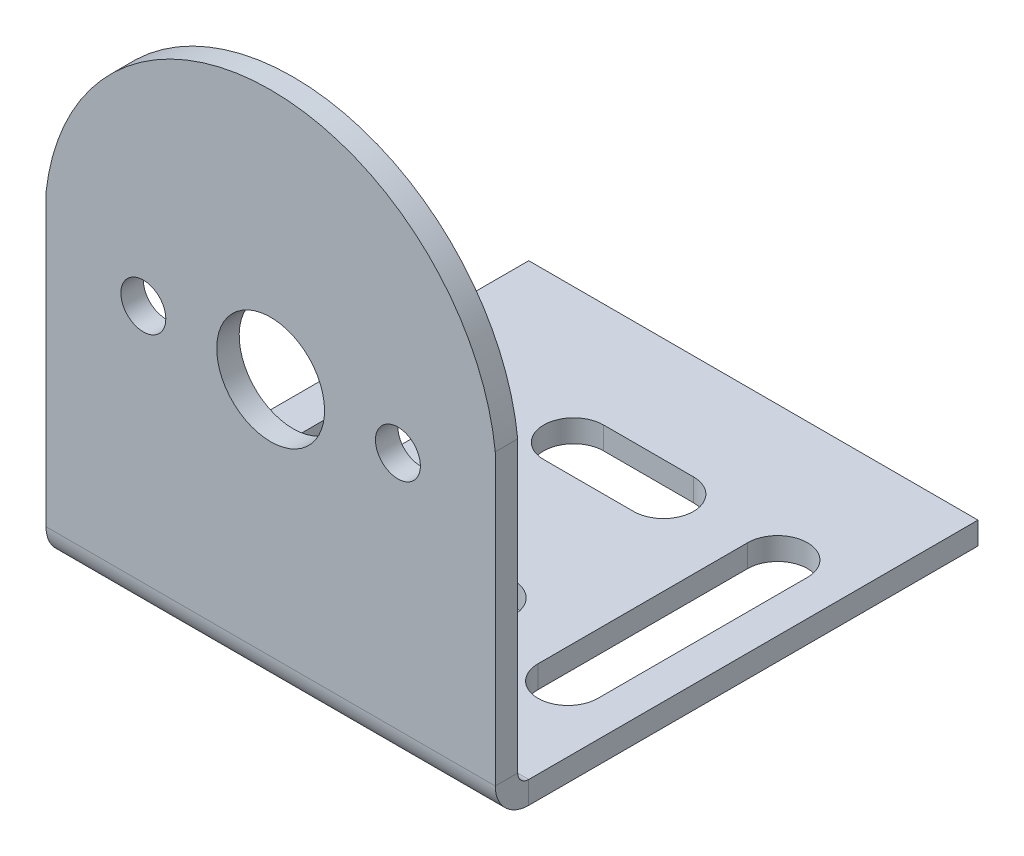
ISO-10303-21;
HEADER;
FILE_DESCRIPTION(('STEP AP214'),'2;1');
FILE_NAME('part.step','',(''),(''),'','','');
FILE_SCHEMA(('AUTOMOTIVE_DESIGN { 1 0 10303 214 1 1 1 1 }'));
ENDSEC;
DATA;
#1=APPLICATION_CONTEXT('core data for automotive mechanical design processes');
#2=APPLICATION_PROTOCOL_DEFINITION('international standard','automotive_design',2000,#1);
#3=PRODUCT_CONTEXT('',#1,'mechanical');
#4=PRODUCT('Part','Part','',(#3));
#5=PRODUCT_RELATED_PRODUCT_CATEGORY('part','',(#4));
#6=PRODUCT_DEFINITION_FORMATION('','',#4);
#7=PRODUCT_DEFINITION_CONTEXT('part definition',#1,'design');
#8=PRODUCT_DEFINITION('design','',#6,#7);
#9=PRODUCT_DEFINITION_SHAPE('','',#8);
#10=(LENGTH_UNIT() NAMED_UNIT(*) SI_UNIT(.MILLI.,.METRE.));
#11=(NAMED_UNIT(*) PLANE_ANGLE_UNIT() SI_UNIT($,.RADIAN.));
#12=(NAMED_UNIT(*) SI_UNIT($,.STERADIAN.) SOLID_ANGLE_UNIT());
#13=UNCERTAINTY_MEASURE_WITH_UNIT(LENGTH_MEASURE(1.E-05),#10,'distance_accuracy_value','');
#14=(GEOMETRIC_REPRESENTATION_CONTEXT(3) GLOBAL_UNCERTAINTY_ASSIGNED_CONTEXT((#13)) GLOBAL_UNIT_ASSIGNED_CONTEXT((#10,
#11,#12)) REPRESENTATION_CONTEXT('',''));
#15=CARTESIAN_POINT('',(0.,0.,0.));
#16=DIRECTION('',(0.,0.,1.));
#17=DIRECTION('',(1.,0.,0.));
#18=AXIS2_PLACEMENT_3D('',#15,#16,#17);
#19=CARTESIAN_POINT('',(-15.,-1.5,15.));
#20=DIRECTION('',(-1.,0.,0.));
#21=DIRECTION('',(0.,0.,1.));
#22=AXIS2_PLACEMENT_3D('',#19,#20,#21);
#23=PLANE('',#22);
#24=DIRECTION('',(0.,0.,1.));
#25=VECTOR('',#24,1.);
#26=CARTESIAN_POINT('',(-15.,0.,15.));
#27=LINE('',#26,#25);
#28=CARTESIAN_POINT('',(-15.,0.,-15.));
#29=VERTEX_POINT('',#28);
#30=CARTESIAN_POINT('',(-15.,0.,15.));
#31=VERTEX_POINT('',#30);
#32=EDGE_CURVE('E421',#29,#31,#27,.T.);
#33=ORIENTED_EDGE('',*,*,#32,.F.);
#34=DIRECTION('',(0.,1.,0.));
#35=VECTOR('',#34,1.);
#36=CARTESIAN_POINT('',(-15.,-1.5,-15.));
#37=LINE('',#36,#35);
#38=CARTESIAN_POINT('',(-15.,-1.5,-15.));
#39=VERTEX_POINT('',#38);
#40=EDGE_CURVE('E13',#39,#29,#37,.T.);
#41=ORIENTED_EDGE('',*,*,#40,.F.);
#42=DIRECTION('',(0.,0.,1.));
#43=VECTOR('',#42,1.);
#44=CARTESIAN_POINT('',(-15.,-1.5,15.));
#45=LINE('',#44,#43);
#46=CARTESIAN_POINT('',(-15.,-1.5,15.));
#47=VERTEX_POINT('',#46);
#48=EDGE_CURVE('E428',#39,#47,#45,.T.);
#49=ORIENTED_EDGE('',*,*,#48,.T.);
#50=DIRECTION('',(0.,1.,0.));
#51=VECTOR('',#50,1.);
#52=CARTESIAN_POINT('',(-15.,-1.5,15.));
#53=LINE('',#52,#51);
#54=EDGE_CURVE('E67',#47,#31,#53,.T.);
#55=ORIENTED_EDGE('',*,*,#54,.T.);
#56=EDGE_LOOP('',(#33,#41,#49,#55));
#57=FACE_BOUND('',#56,.T.);
#58=ADVANCED_FACE('F64',(#57),#23,.T.);
#59=CARTESIAN_POINT('',(15.,-1.5,-15.));
#60=DIRECTION('',(0.,0.,-1.));
#61=DIRECTION('',(-1.,0.,0.));
#62=AXIS2_PLACEMENT_3D('',#59,#60,#61);
#63=PLANE('',#62);
#64=DIRECTION('',(-1.,0.,0.));
#65=VECTOR('',#64,1.);
#66=CARTESIAN_POINT('',(15.,0.,-15.));
#67=LINE('',#66,#65);
#68=CARTESIAN_POINT('',(15.,0.,-15.));
#69=VERTEX_POINT('',#68);
#70=EDGE_CURVE('E431',#69,#29,#67,.T.);
#71=ORIENTED_EDGE('',*,*,#70,.F.);
#72=DIRECTION('',(0.,1.,0.));
#73=VECTOR('',#72,1.);
#74=CARTESIAN_POINT('',(15.,-1.5,-15.));
#75=LINE('',#74,#73);
#76=CARTESIAN_POINT('',(15.,-1.5,-15.));
#77=VERTEX_POINT('',#76);
#78=EDGE_CURVE('E72',#77,#69,#75,.T.);
#79=ORIENTED_EDGE('',*,*,#78,.F.);
#80=DIRECTION('',(-1.,0.,0.));
#81=VECTOR('',#80,1.);
#82=CARTESIAN_POINT('',(15.,-1.5,-15.));
#83=LINE('',#82,#81);
#84=EDGE_CURVE('E436',#77,#39,#83,.T.);
#85=ORIENTED_EDGE('',*,*,#84,.T.);
#86=ORIENTED_EDGE('',*,*,#40,.T.);
#87=EDGE_LOOP('',(#71,#79,#85,#86));
#88=FACE_BOUND('',#87,.T.);
#89=ADVANCED_FACE('F489',(#88),#63,.T.);
#90=CARTESIAN_POINT('',(15.,-1.5,15.));
#91=DIRECTION('',(1.,0.,0.));
#92=DIRECTION('',(0.,0.,-1.));
#93=AXIS2_PLACEMENT_3D('',#90,#91,#92);
#94=PLANE('',#93);
#95=DIRECTION('',(0.,0.,-1.));
#96=VECTOR('',#95,1.);
#97=CARTESIAN_POINT('',(15.,0.,15.));
#98=LINE('',#97,#96);
#99=CARTESIAN_POINT('',(15.,0.,15.));
#100=VERTEX_POINT('',#99);
#101=EDGE_CURVE('E444',#100,#69,#98,.T.);
#102=ORIENTED_EDGE('',*,*,#101,.F.);
#103=DIRECTION('',(0.,1.,0.));
#104=VECTOR('',#103,1.);
#105=CARTESIAN_POINT('',(15.,-1.5,15.));
#106=LINE('',#105,#104);
#107=CARTESIAN_POINT('',(15.,-1.50000000000001,15.));
#108=VERTEX_POINT('',#107);
#109=EDGE_CURVE('E449',#108,#100,#106,.T.);
#110=ORIENTED_EDGE('',*,*,#109,.F.);
#111=DIRECTION('',(0.,0.,-1.));
#112=VECTOR('',#111,1.);
#113=CARTESIAN_POINT('',(15.,-1.5,15.));
#114=LINE('',#113,#112);
#115=EDGE_CURVE('E433',#108,#77,#114,.T.);
#116=ORIENTED_EDGE('',*,*,#115,.T.);
#117=ORIENTED_EDGE('',*,*,#78,.T.);
#118=EDGE_LOOP('',(#102,#110,#116,#117));
#119=FACE_BOUND('',#118,.T.);
#120=ADVANCED_FACE('F493',(#119),#94,.T.);
#121=CARTESIAN_POINT('',(0.,-1.5,0.));
#122=DIRECTION('',(0.,1.,0.));
#123=DIRECTION('',(0.,0.,1.));
#124=AXIS2_PLACEMENT_3D('',#121,#122,#123);
#125=PLANE('',#124);
#126=DIRECTION('',(-1.,0.,0.));
#127=VECTOR('',#126,1.);
#128=CARTESIAN_POINT('',(-3.,-1.5,4.));
#129=LINE('',#128,#127);
#130=CARTESIAN_POINT('',(3.,-1.5,4.00000000000001));
#131=VERTEX_POINT('',#130);
#132=CARTESIAN_POINT('',(-3.,-1.5,4.));
#133=VERTEX_POINT('',#132);
#134=EDGE_CURVE('E311',#131,#133,#129,.T.);
#135=ORIENTED_EDGE('',*,*,#134,.T.);
#136=CARTESIAN_POINT('',(-3.,-1.5,6.));
#137=DIRECTION('',(0.,1.,0.));
#138=DIRECTION('',(0.,0.,-1.));
#139=AXIS2_PLACEMENT_3D('',#136,#137,#138);
#140=CIRCLE('',#139,2.);
#141=CARTESIAN_POINT('',(-3.,-1.5,8.));
#142=VERTEX_POINT('',#141);
#143=EDGE_CURVE('E303',#133,#142,#140,.T.);
#144=ORIENTED_EDGE('',*,*,#143,.T.);
#145=DIRECTION('',(1.,0.,0.));
#146=VECTOR('',#145,1.);
#147=CARTESIAN_POINT('',(-3.,-1.5,8.));
#148=LINE('',#147,#146);
#149=CARTESIAN_POINT('',(3.,-1.5,8.));
#150=VERTEX_POINT('',#149);
#151=EDGE_CURVE('E306',#142,#150,#148,.T.);
#152=ORIENTED_EDGE('',*,*,#151,.T.);
#153=CARTESIAN_POINT('',(3.,-1.5,6.));
#154=DIRECTION('',(0.,1.,0.));
#155=DIRECTION('',(0.,0.,-1.));
#156=AXIS2_PLACEMENT_3D('',#153,#154,#155);
#157=CIRCLE('',#156,2.);
#158=EDGE_CURVE('E80',#150,#131,#157,.T.);
#159=ORIENTED_EDGE('',*,*,#158,.T.);
#160=EDGE_LOOP('',(#135,#144,#152,#159));
#161=FACE_BOUND('',#160,.T.);
#162=DIRECTION('',(-1.,0.,0.));
#163=VECTOR('',#162,1.);
#164=CARTESIAN_POINT('',(-3.,-1.5,-8.));
#165=LINE('',#164,#163);
#166=CARTESIAN_POINT('',(3.,-1.5,-8.));
#167=VERTEX_POINT('',#166);
#168=CARTESIAN_POINT('',(-3.,-1.5,-8.));
#169=VERTEX_POINT('',#168);
#170=EDGE_CURVE('E342',#167,#169,#165,.T.);
#171=ORIENTED_EDGE('',*,*,#170,.T.);
#172=CARTESIAN_POINT('',(-3.,-1.5,-6.));
#173=DIRECTION('',(0.,1.,0.));
#174=DIRECTION('',(0.,0.,1.));
#175=AXIS2_PLACEMENT_3D('',#172,#173,#174);
#176=CIRCLE('',#175,2.);
#177=CARTESIAN_POINT('',(-3.,-1.5,-4.));
#178=VERTEX_POINT('',#177);
#179=EDGE_CURVE('E332',#169,#178,#176,.T.);
#180=ORIENTED_EDGE('',*,*,#179,.T.);
#181=DIRECTION('',(1.,0.,0.));
#182=VECTOR('',#181,1.);
#183=CARTESIAN_POINT('',(-3.,-1.5,-4.));
#184=LINE('',#183,#182);
#185=CARTESIAN_POINT('',(3.,-1.5,-4.));
#186=VERTEX_POINT('',#185);
#187=EDGE_CURVE('E335',#178,#186,#184,.T.);
#188=ORIENTED_EDGE('',*,*,#187,.T.);
#189=CARTESIAN_POINT('',(3.,-1.5,-6.));
#190=DIRECTION('',(0.,1.,0.));
#191=DIRECTION('',(0.,0.,1.));
#192=AXIS2_PLACEMENT_3D('',#189,#190,#191);
#193=CIRCLE('',#192,2.);
#194=EDGE_CURVE('E339',#186,#167,#193,.T.);
#195=ORIENTED_EDGE('',*,*,#194,.T.);
#196=EDGE_LOOP('',(#171,#180,#188,#195));
#197=FACE_BOUND('',#196,.T.);
#198=DIRECTION('',(0.,0.,-1.));
#199=VECTOR('',#198,1.);
#200=CARTESIAN_POINT('',(12.6177163636364,-1.5,-6.));
#201=LINE('',#200,#199);
#202=CARTESIAN_POINT('',(12.6177163636364,-1.5,8.));
#203=VERTEX_POINT('',#202);
#204=CARTESIAN_POINT('',(12.6177163636364,-1.5,-6.));
#205=VERTEX_POINT('',#204);
#206=EDGE_CURVE('E374',#203,#205,#201,.T.);
#207=ORIENTED_EDGE('',*,*,#206,.T.);
#208=CARTESIAN_POINT('',(10.6177163636364,-1.5,-6.));
#209=DIRECTION('',(0.,1.,0.));
#210=DIRECTION('',(0.,0.,-1.));
#211=AXIS2_PLACEMENT_3D('',#208,#209,#210);
#212=CIRCLE('',#211,2.);
#213=CARTESIAN_POINT('',(8.61771636363635,-1.5,-6.));
#214=VERTEX_POINT('',#213);
#215=EDGE_CURVE('E364',#205,#214,#212,.T.);
#216=ORIENTED_EDGE('',*,*,#215,.T.);
#217=DIRECTION('',(0.,0.,1.));
#218=VECTOR('',#217,1.);
#219=CARTESIAN_POINT('',(8.61771636363635,-1.5,-6.));
#220=LINE('',#219,#218);
#221=CARTESIAN_POINT('',(8.61771636363635,-1.5,8.));
#222=VERTEX_POINT('',#221);
#223=EDGE_CURVE('E367',#214,#222,#220,.T.);
#224=ORIENTED_EDGE('',*,*,#223,.T.);
#225=CARTESIAN_POINT('',(10.6177163636364,-1.5,8.));
#226=DIRECTION('',(0.,1.,0.));
#227=DIRECTION('',(0.,0.,-1.));
#228=AXIS2_PLACEMENT_3D('',#225,#226,#227);
#229=CIRCLE('',#228,2.);
#230=EDGE_CURVE('E371',#222,#203,#229,.T.);
#231=ORIENTED_EDGE('',*,*,#230,.T.);
#232=EDGE_LOOP('',(#207,#216,#224,#231));
#233=FACE_BOUND('',#232,.T.);
#234=DIRECTION('',(0.,0.,-1.));
#235=VECTOR('',#234,1.);
#236=CARTESIAN_POINT('',(-8.61771636363636,-1.5,-6.));
#237=LINE('',#236,#235);
#238=CARTESIAN_POINT('',(-8.61771636363635,-1.5,8.));
#239=VERTEX_POINT('',#238);
#240=CARTESIAN_POINT('',(-8.61771636363636,-1.5,-6.));
#241=VERTEX_POINT('',#240);
#242=EDGE_CURVE('E406',#239,#241,#237,.T.);
#243=ORIENTED_EDGE('',*,*,#242,.T.);
#244=CARTESIAN_POINT('',(-10.6177163636364,-1.5,-6.));
#245=DIRECTION('',(0.,1.,0.));
#246=DIRECTION('',(0.,0.,1.));
#247=AXIS2_PLACEMENT_3D('',#244,#245,#246);
#248=CIRCLE('',#247,2.);
#249=CARTESIAN_POINT('',(-12.6177163636364,-1.5,-6.));
#250=VERTEX_POINT('',#249);
#251=EDGE_CURVE('E396',#241,#250,#248,.T.);
#252=ORIENTED_EDGE('',*,*,#251,.T.);
#253=DIRECTION('',(0.,0.,1.));
#254=VECTOR('',#253,1.);
#255=CARTESIAN_POINT('',(-12.6177163636364,-1.5,-6.));
#256=LINE('',#255,#254);
#257=CARTESIAN_POINT('',(-12.6177163636364,-1.5,8.));
#258=VERTEX_POINT('',#257);
#259=EDGE_CURVE('E399',#250,#258,#256,.T.);
#260=ORIENTED_EDGE('',*,*,#259,.T.);
#261=CARTESIAN_POINT('',(-10.6177163636364,-1.5,8.));
#262=DIRECTION('',(0.,1.,0.));
#263=DIRECTION('',(0.,0.,1.));
#264=AXIS2_PLACEMENT_3D('',#261,#262,#263);
#265=CIRCLE('',#264,2.);
#266=EDGE_CURVE('E403',#258,#239,#265,.T.);
#267=ORIENTED_EDGE('',*,*,#266,.T.);
#268=EDGE_LOOP('',(#243,#252,#260,#267));
#269=FACE_BOUND('',#268,.T.);
#270=ORIENTED_EDGE('',*,*,#48,.F.);
#271=ORIENTED_EDGE('',*,*,#84,.F.);
#272=ORIENTED_EDGE('',*,*,#115,.F.);
#273=DIRECTION('',(1.,0.,0.));
#274=VECTOR('',#273,1.);
#275=CARTESIAN_POINT('',(15.,-1.5,15.));
#276=LINE('',#275,#274);
#277=EDGE_CURVE('E232',#47,#108,#276,.T.);
#278=ORIENTED_EDGE('',*,*,#277,.F.);
#279=EDGE_LOOP('',(#270,#271,#272,#278));
#280=FACE_BOUND('',#279,.T.);
#281=ADVANCED_FACE('F499',(#161,#197,#233,#269,#280),#125,.F.);
#282=CARTESIAN_POINT('',(0.,0.,0.));
#283=DIRECTION('',(0.,1.,0.));
#284=DIRECTION('',(0.,0.,1.));
#285=AXIS2_PLACEMENT_3D('',#282,#283,#284);
#286=PLANE('',#285);
#287=CARTESIAN_POINT('',(-3.,0.,6.));
#288=DIRECTION('',(0.,1.,0.));
#289=DIRECTION('',(0.,0.,-1.));
#290=AXIS2_PLACEMENT_3D('',#287,#288,#289);
#291=CIRCLE('',#290,2.);
#292=CARTESIAN_POINT('',(-3.,0.,4.));
#293=VERTEX_POINT('',#292);
#294=CARTESIAN_POINT('',(-3.,0.,8.));
#295=VERTEX_POINT('',#294);
#296=EDGE_CURVE('E88',#293,#295,#291,.T.);
#297=ORIENTED_EDGE('',*,*,#296,.F.);
#298=DIRECTION('',(-1.,0.,0.));
#299=VECTOR('',#298,1.);
#300=CARTESIAN_POINT('',(-3.,0.,4.));
#301=LINE('',#300,#299);
#302=CARTESIAN_POINT('',(3.,0.,4.00000000000001));
#303=VERTEX_POINT('',#302);
#304=EDGE_CURVE('E307',#303,#293,#301,.T.);
#305=ORIENTED_EDGE('',*,*,#304,.F.);
#306=CARTESIAN_POINT('',(3.,0.,6.));
#307=DIRECTION('',(0.,1.,0.));
#308=DIRECTION('',(0.,0.,-1.));
#309=AXIS2_PLACEMENT_3D('',#306,#307,#308);
#310=CIRCLE('',#309,2.);
#311=CARTESIAN_POINT('',(3.,0.,8.));
#312=VERTEX_POINT('',#311);
#313=EDGE_CURVE('E319',#312,#303,#310,.T.);
#314=ORIENTED_EDGE('',*,*,#313,.F.);
#315=DIRECTION('',(1.,0.,0.));
#316=VECTOR('',#315,1.);
#317=CARTESIAN_POINT('',(-3.,0.,8.));
#318=LINE('',#317,#316);
#319=EDGE_CURVE('E316',#295,#312,#318,.T.);
#320=ORIENTED_EDGE('',*,*,#319,.F.);
#321=EDGE_LOOP('',(#297,#305,#314,#320));
#322=FACE_BOUND('',#321,.T.);
#323=CARTESIAN_POINT('',(-3.,0.,-6.));
#324=DIRECTION('',(0.,1.,0.));
#325=DIRECTION('',(0.,0.,1.));
#326=AXIS2_PLACEMENT_3D('',#323,#324,#325);
#327=CIRCLE('',#326,2.);
#328=CARTESIAN_POINT('',(-3.,0.,-8.));
#329=VERTEX_POINT('',#328);
#330=CARTESIAN_POINT('',(-3.,0.,-4.));
#331=VERTEX_POINT('',#330);
#332=EDGE_CURVE('E326',#329,#331,#327,.T.);
#333=ORIENTED_EDGE('',*,*,#332,.F.);
#334=DIRECTION('',(-1.,0.,0.));
#335=VECTOR('',#334,1.);
#336=CARTESIAN_POINT('',(-3.,0.,-8.));
#337=LINE('',#336,#335);
#338=CARTESIAN_POINT('',(3.,0.,-8.));
#339=VERTEX_POINT('',#338);
#340=EDGE_CURVE('E336',#339,#329,#337,.T.);
#341=ORIENTED_EDGE('',*,*,#340,.F.);
#342=CARTESIAN_POINT('',(3.,0.,-6.));
#343=DIRECTION('',(0.,1.,0.));
#344=DIRECTION('',(0.,0.,1.));
#345=AXIS2_PLACEMENT_3D('',#342,#343,#344);
#346=CIRCLE('',#345,2.);
#347=CARTESIAN_POINT('',(3.,0.,-4.));
#348=VERTEX_POINT('',#347);
#349=EDGE_CURVE('E350',#348,#339,#346,.T.);
#350=ORIENTED_EDGE('',*,*,#349,.F.);
#351=DIRECTION('',(1.,0.,0.));
#352=VECTOR('',#351,1.);
#353=CARTESIAN_POINT('',(-3.,0.,-4.));
#354=LINE('',#353,#352);
#355=EDGE_CURVE('E347',#331,#348,#354,.T.);
#356=ORIENTED_EDGE('',*,*,#355,.F.);
#357=EDGE_LOOP('',(#333,#341,#350,#356));
#358=FACE_BOUND('',#357,.T.);
#359=CARTESIAN_POINT('',(10.6177163636364,0.,-6.));
#360=DIRECTION('',(0.,1.,0.));
#361=DIRECTION('',(0.,0.,-1.));
#362=AXIS2_PLACEMENT_3D('',#359,#360,#361);
#363=CIRCLE('',#362,2.);
#364=CARTESIAN_POINT('',(12.6177163636364,0.,-6.));
#365=VERTEX_POINT('',#364);
#366=CARTESIAN_POINT('',(8.61771636363635,0.,-6.));
#367=VERTEX_POINT('',#366);
#368=EDGE_CURVE('E357',#365,#367,#363,.T.);
#369=ORIENTED_EDGE('',*,*,#368,.F.);
#370=DIRECTION('',(0.,0.,-1.));
#371=VECTOR('',#370,1.);
#372=CARTESIAN_POINT('',(12.6177163636364,0.,-6.));
#373=LINE('',#372,#371);
#374=CARTESIAN_POINT('',(12.6177163636364,0.,8.));
#375=VERTEX_POINT('',#374);
#376=EDGE_CURVE('E368',#375,#365,#373,.T.);
#377=ORIENTED_EDGE('',*,*,#376,.F.);
#378=CARTESIAN_POINT('',(10.6177163636364,0.,8.));
#379=DIRECTION('',(0.,1.,0.));
#380=DIRECTION('',(0.,0.,-1.));
#381=AXIS2_PLACEMENT_3D('',#378,#379,#380);
#382=CIRCLE('',#381,2.);
#383=CARTESIAN_POINT('',(8.61771636363635,0.,8.));
#384=VERTEX_POINT('',#383);
#385=EDGE_CURVE('E382',#384,#375,#382,.T.);
#386=ORIENTED_EDGE('',*,*,#385,.F.);
#387=DIRECTION('',(0.,0.,1.));
#388=VECTOR('',#387,1.);
#389=CARTESIAN_POINT('',(8.61771636363635,0.,-6.));
#390=LINE('',#389,#388);
#391=EDGE_CURVE('E379',#367,#384,#390,.T.);
#392=ORIENTED_EDGE('',*,*,#391,.F.);
#393=EDGE_LOOP('',(#369,#377,#386,#392));
#394=FACE_BOUND('',#393,.T.);
#395=CARTESIAN_POINT('',(-10.6177163636364,0.,-6.));
#396=DIRECTION('',(0.,1.,0.));
#397=DIRECTION('',(0.,0.,1.));
#398=AXIS2_PLACEMENT_3D('',#395,#396,#397);
#399=CIRCLE('',#398,2.);
#400=CARTESIAN_POINT('',(-8.61771636363636,0.,-6.));
#401=VERTEX_POINT('',#400);
#402=CARTESIAN_POINT('',(-12.6177163636364,0.,-6.));
#403=VERTEX_POINT('',#402);
#404=EDGE_CURVE('E389',#401,#403,#399,.T.);
#405=ORIENTED_EDGE('',*,*,#404,.F.);
#406=DIRECTION('',(0.,0.,-1.));
#407=VECTOR('',#406,1.);
#408=CARTESIAN_POINT('',(-8.61771636363636,0.,-6.));
#409=LINE('',#408,#407);
#410=CARTESIAN_POINT('',(-8.61771636363635,0.,8.));
#411=VERTEX_POINT('',#410);
#412=EDGE_CURVE('E400',#411,#401,#409,.T.);
#413=ORIENTED_EDGE('',*,*,#412,.F.);
#414=CARTESIAN_POINT('',(-10.6177163636364,0.,8.));
#415=DIRECTION('',(0.,1.,0.));
#416=DIRECTION('',(0.,0.,1.));
#417=AXIS2_PLACEMENT_3D('',#414,#415,#416);
#418=CIRCLE('',#417,2.);
#419=CARTESIAN_POINT('',(-12.6177163636364,0.,8.));
#420=VERTEX_POINT('',#419);
#421=EDGE_CURVE('E414',#420,#411,#418,.T.);
#422=ORIENTED_EDGE('',*,*,#421,.F.);
#423=DIRECTION('',(0.,0.,1.));
#424=VECTOR('',#423,1.);
#425=CARTESIAN_POINT('',(-12.6177163636364,0.,-6.));
#426=LINE('',#425,#424);
#427=EDGE_CURVE('E411',#403,#420,#426,.T.);
#428=ORIENTED_EDGE('',*,*,#427,.F.);
#429=EDGE_LOOP('',(#405,#413,#422,#428));
#430=FACE_BOUND('',#429,.T.);
#431=ORIENTED_EDGE('',*,*,#32,.T.);
#432=DIRECTION('',(1.,0.,0.));
#433=VECTOR('',#432,1.);
#434=CARTESIAN_POINT('',(15.,0.,15.));
#435=LINE('',#434,#433);
#436=EDGE_CURVE('E441',#31,#100,#435,.T.);
#437=ORIENTED_EDGE('',*,*,#436,.T.);
#438=ORIENTED_EDGE('',*,*,#101,.T.);
#439=ORIENTED_EDGE('',*,*,#70,.T.);
#440=EDGE_LOOP('',(#431,#437,#438,#439));
#441=FACE_BOUND('',#440,.T.);
#442=ADVANCED_FACE('F459',(#322,#358,#394,#430,#441),#286,.T.);
#443=CARTESIAN_POINT('',(-10.6177163636364,-1.5,-6.));
#444=DIRECTION('',(0.,1.,0.));
#445=DIRECTION('',(0.,0.,1.));
#446=AXIS2_PLACEMENT_3D('',#443,#444,#445);
#447=CYLINDRICAL_SURFACE('',#446,2.);
#448=ORIENTED_EDGE('',*,*,#404,.T.);
#449=DIRECTION('',(0.,1.,0.));
#450=VECTOR('',#449,1.);
#451=CARTESIAN_POINT('',(-12.6177163636364,-1.5,-6.));
#452=LINE('',#451,#450);
#453=EDGE_CURVE('E409',#250,#403,#452,.T.);
#454=ORIENTED_EDGE('',*,*,#453,.F.);
#455=ORIENTED_EDGE('',*,*,#251,.F.);
#456=DIRECTION('',(0.,1.,0.));
#457=VECTOR('',#456,1.);
#458=CARTESIAN_POINT('',(-8.61771636363636,-1.5,-6.));
#459=LINE('',#458,#457);
#460=EDGE_CURVE('E419',#241,#401,#459,.T.);
#461=ORIENTED_EDGE('',*,*,#460,.T.);
#462=EDGE_LOOP('',(#448,#454,#455,#461));
#463=FACE_BOUND('',#462,.T.);
#464=ADVANCED_FACE('F504',(#463),#447,.F.);
#465=CARTESIAN_POINT('',(-8.61771636363636,-1.5,-6.));
#466=DIRECTION('',(1.,0.,0.));
#467=DIRECTION('',(0.,0.,-1.));
#468=AXIS2_PLACEMENT_3D('',#465,#466,#467);
#469=PLANE('',#468);
#470=ORIENTED_EDGE('',*,*,#412,.T.);
#471=ORIENTED_EDGE('',*,*,#460,.F.);
#472=ORIENTED_EDGE('',*,*,#242,.F.);
#473=DIRECTION('',(0.,1.,0.));
#474=VECTOR('',#473,1.);
#475=CARTESIAN_POINT('',(-8.61771636363635,-1.5,8.));
#476=LINE('',#475,#474);
#477=EDGE_CURVE('E422',#239,#411,#476,.T.);
#478=ORIENTED_EDGE('',*,*,#477,.T.);
#479=EDGE_LOOP('',(#470,#471,#472,#478));
#480=FACE_BOUND('',#479,.T.);
#481=ADVANCED_FACE('F511',(#480),#469,.F.);
#482=CARTESIAN_POINT('',(-10.6177163636364,-1.5,8.));
#483=DIRECTION('',(0.,1.,0.));
#484=DIRECTION('',(0.,0.,1.));
#485=AXIS2_PLACEMENT_3D('',#482,#483,#484);
#486=CYLINDRICAL_SURFACE('',#485,2.);
#487=ORIENTED_EDGE('',*,*,#421,.T.);
#488=ORIENTED_EDGE('',*,*,#477,.F.);
#489=ORIENTED_EDGE('',*,*,#266,.F.);
#490=DIRECTION('',(0.,1.,0.));
#491=VECTOR('',#490,1.);
#492=CARTESIAN_POINT('',(-12.6177163636364,-1.5,8.));
#493=LINE('',#492,#491);
#494=EDGE_CURVE('E424',#258,#420,#493,.T.);
#495=ORIENTED_EDGE('',*,*,#494,.T.);
#496=EDGE_LOOP('',(#487,#488,#489,#495));
#497=FACE_BOUND('',#496,.T.);
#498=ADVANCED_FACE('F517',(#497),#486,.F.);
#499=CARTESIAN_POINT('',(-12.6177163636364,-1.5,-6.));
#500=DIRECTION('',(-1.,0.,0.));
#501=DIRECTION('',(0.,0.,1.));
#502=AXIS2_PLACEMENT_3D('',#499,#500,#501);
#503=PLANE('',#502);
#504=ORIENTED_EDGE('',*,*,#427,.T.);
#505=ORIENTED_EDGE('',*,*,#494,.F.);
#506=ORIENTED_EDGE('',*,*,#259,.F.);
#507=ORIENTED_EDGE('',*,*,#453,.T.);
#508=EDGE_LOOP('',(#504,#505,#506,#507));
#509=FACE_BOUND('',#508,.T.);
#510=ADVANCED_FACE('F513',(#509),#503,.F.);
#511=CARTESIAN_POINT('',(10.6177163636364,-1.5,-6.));
#512=DIRECTION('',(0.,1.,0.));
#513=DIRECTION('',(0.,0.,1.));
#514=AXIS2_PLACEMENT_3D('',#511,#512,#513);
#515=CYLINDRICAL_SURFACE('',#514,2.);
#516=ORIENTED_EDGE('',*,*,#368,.T.);
#517=DIRECTION('',(0.,1.,0.));
#518=VECTOR('',#517,1.);
#519=CARTESIAN_POINT('',(8.61771636363635,-1.5,-6.));
#520=LINE('',#519,#518);
#521=EDGE_CURVE('E377',#214,#367,#520,.T.);
#522=ORIENTED_EDGE('',*,*,#521,.F.);
#523=ORIENTED_EDGE('',*,*,#215,.F.);
#524=DIRECTION('',(0.,1.,0.));
#525=VECTOR('',#524,1.);
#526=CARTESIAN_POINT('',(12.6177163636364,-1.5,-6.));
#527=LINE('',#526,#525);
#528=EDGE_CURVE('E387',#205,#365,#527,.T.);
#529=ORIENTED_EDGE('',*,*,#528,.T.);
#530=EDGE_LOOP('',(#516,#522,#523,#529));
#531=FACE_BOUND('',#530,.T.);
#532=ADVANCED_FACE('F516',(#531),#515,.F.);
#533=CARTESIAN_POINT('',(12.6177163636364,-1.5,-6.));
#534=DIRECTION('',(1.,0.,0.));
#535=DIRECTION('',(0.,0.,-1.));
#536=AXIS2_PLACEMENT_3D('',#533,#534,#535);
#537=PLANE('',#536);
#538=ORIENTED_EDGE('',*,*,#376,.T.);
#539=ORIENTED_EDGE('',*,*,#528,.F.);
#540=ORIENTED_EDGE('',*,*,#206,.F.);
#541=DIRECTION('',(0.,1.,0.));
#542=VECTOR('',#541,1.);
#543=CARTESIAN_POINT('',(12.6177163636364,-1.5,8.));
#544=LINE('',#543,#542);
#545=EDGE_CURVE('E390',#203,#375,#544,.T.);
#546=ORIENTED_EDGE('',*,*,#545,.T.);
#547=EDGE_LOOP('',(#538,#539,#540,#546));
#548=FACE_BOUND('',#547,.T.);
#549=ADVANCED_FACE('F527',(#548),#537,.F.);
#550=CARTESIAN_POINT('',(10.6177163636364,-1.5,8.));
#551=DIRECTION('',(0.,1.,0.));
#552=DIRECTION('',(0.,0.,1.));
#553=AXIS2_PLACEMENT_3D('',#550,#551,#552);
#554=CYLINDRICAL_SURFACE('',#553,2.);
#555=ORIENTED_EDGE('',*,*,#385,.T.);
#556=ORIENTED_EDGE('',*,*,#545,.F.);
#557=ORIENTED_EDGE('',*,*,#230,.F.);
#558=DIRECTION('',(0.,1.,0.));
#559=VECTOR('',#558,1.);
#560=CARTESIAN_POINT('',(8.61771636363635,-1.5,8.));
#561=LINE('',#560,#559);
#562=EDGE_CURVE('E392',#222,#384,#561,.T.);
#563=ORIENTED_EDGE('',*,*,#562,.T.);
#564=EDGE_LOOP('',(#555,#556,#557,#563));
#565=FACE_BOUND('',#564,.T.);
#566=ADVANCED_FACE('F533',(#565),#554,.F.);
#567=CARTESIAN_POINT('',(8.61771636363635,-1.5,-6.));
#568=DIRECTION('',(-1.,0.,0.));
#569=DIRECTION('',(0.,0.,1.));
#570=AXIS2_PLACEMENT_3D('',#567,#568,#569);
#571=PLANE('',#570);
#572=ORIENTED_EDGE('',*,*,#391,.T.);
#573=ORIENTED_EDGE('',*,*,#562,.F.);
#574=ORIENTED_EDGE('',*,*,#223,.F.);
#575=ORIENTED_EDGE('',*,*,#521,.T.);
#576=EDGE_LOOP('',(#572,#573,#574,#575));
#577=FACE_BOUND('',#576,.T.);
#578=ADVANCED_FACE('F529',(#577),#571,.F.);
#579=CARTESIAN_POINT('',(-3.,-1.5,-6.));
#580=DIRECTION('',(0.,1.,0.));
#581=DIRECTION('',(0.,0.,1.));
#582=AXIS2_PLACEMENT_3D('',#579,#580,#581);
#583=CYLINDRICAL_SURFACE('',#582,2.);
#584=ORIENTED_EDGE('',*,*,#332,.T.);
#585=DIRECTION('',(0.,1.,0.));
#586=VECTOR('',#585,1.);
#587=CARTESIAN_POINT('',(-3.,-1.5,-4.));
#588=LINE('',#587,#586);
#589=EDGE_CURVE('E345',#178,#331,#588,.T.);
#590=ORIENTED_EDGE('',*,*,#589,.F.);
#591=ORIENTED_EDGE('',*,*,#179,.F.);
#592=DIRECTION('',(0.,1.,0.));
#593=VECTOR('',#592,1.);
#594=CARTESIAN_POINT('',(-3.,-1.5,-8.));
#595=LINE('',#594,#593);
#596=EDGE_CURVE('E355',#169,#329,#595,.T.);
#597=ORIENTED_EDGE('',*,*,#596,.T.);
#598=EDGE_LOOP('',(#584,#590,#591,#597));
#599=FACE_BOUND('',#598,.T.);
#600=ADVANCED_FACE('F532',(#599),#583,.F.);
#601=CARTESIAN_POINT('',(-3.,-1.5,-8.));
#602=DIRECTION('',(0.,0.,-1.));
#603=DIRECTION('',(-1.,0.,0.));
#604=AXIS2_PLACEMENT_3D('',#601,#602,#603);
#605=PLANE('',#604);
#606=ORIENTED_EDGE('',*,*,#340,.T.);
#607=ORIENTED_EDGE('',*,*,#596,.F.);
#608=ORIENTED_EDGE('',*,*,#170,.F.);
#609=DIRECTION('',(0.,1.,0.));
#610=VECTOR('',#609,1.);
#611=CARTESIAN_POINT('',(3.,-1.5,-8.));
#612=LINE('',#611,#610);
#613=EDGE_CURVE('E358',#167,#339,#612,.T.);
#614=ORIENTED_EDGE('',*,*,#613,.T.);
#615=EDGE_LOOP('',(#606,#607,#608,#614));
#616=FACE_BOUND('',#615,.T.);
#617=ADVANCED_FACE('F543',(#616),#605,.F.);
#618=CARTESIAN_POINT('',(3.,-1.5,-6.));
#619=DIRECTION('',(0.,1.,0.));
#620=DIRECTION('',(0.,0.,1.));
#621=AXIS2_PLACEMENT_3D('',#618,#619,#620);
#622=CYLINDRICAL_SURFACE('',#621,2.);
#623=ORIENTED_EDGE('',*,*,#349,.T.);
#624=ORIENTED_EDGE('',*,*,#613,.F.);
#625=ORIENTED_EDGE('',*,*,#194,.F.);
#626=DIRECTION('',(0.,1.,0.));
#627=VECTOR('',#626,1.);
#628=CARTESIAN_POINT('',(3.,-1.5,-4.));
#629=LINE('',#628,#627);
#630=EDGE_CURVE('E360',#186,#348,#629,.T.);
#631=ORIENTED_EDGE('',*,*,#630,.T.);
#632=EDGE_LOOP('',(#623,#624,#625,#631));
#633=FACE_BOUND('',#632,.T.);
#634=ADVANCED_FACE('F549',(#633),#622,.F.);
#635=CARTESIAN_POINT('',(-3.,-1.5,-4.));
#636=DIRECTION('',(0.,0.,1.));
#637=DIRECTION('',(1.,0.,0.));
#638=AXIS2_PLACEMENT_3D('',#635,#636,#637);
#639=PLANE('',#638);
#640=ORIENTED_EDGE('',*,*,#355,.T.);
#641=ORIENTED_EDGE('',*,*,#630,.F.);
#642=ORIENTED_EDGE('',*,*,#187,.F.);
#643=ORIENTED_EDGE('',*,*,#589,.T.);
#644=EDGE_LOOP('',(#640,#641,#642,#643));
#645=FACE_BOUND('',#644,.T.);
#646=ADVANCED_FACE('F545',(#645),#639,.F.);
#647=CARTESIAN_POINT('',(-3.,-1.5,6.));
#648=DIRECTION('',(0.,1.,0.));
#649=DIRECTION('',(0.,0.,1.));
#650=AXIS2_PLACEMENT_3D('',#647,#648,#649);
#651=CYLINDRICAL_SURFACE('',#650,2.);
#652=ORIENTED_EDGE('',*,*,#296,.T.);
#653=DIRECTION('',(0.,1.,0.));
#654=VECTOR('',#653,1.);
#655=CARTESIAN_POINT('',(-3.,-1.5,8.));
#656=LINE('',#655,#654);
#657=EDGE_CURVE('E314',#142,#295,#656,.T.);
#658=ORIENTED_EDGE('',*,*,#657,.F.);
#659=ORIENTED_EDGE('',*,*,#143,.F.);
#660=DIRECTION('',(0.,1.,0.));
#661=VECTOR('',#660,1.);
#662=CARTESIAN_POINT('',(-3.,-1.5,4.));
#663=LINE('',#662,#661);
#664=EDGE_CURVE('E324',#133,#293,#663,.T.);
#665=ORIENTED_EDGE('',*,*,#664,.T.);
#666=EDGE_LOOP('',(#652,#658,#659,#665));
#667=FACE_BOUND('',#666,.T.);
#668=ADVANCED_FACE('F548',(#667),#651,.F.);
#669=CARTESIAN_POINT('',(-3.,-1.5,4.));
#670=DIRECTION('',(0.,0.,-1.));
#671=DIRECTION('',(-1.,0.,0.));
#672=AXIS2_PLACEMENT_3D('',#669,#670,#671);
#673=PLANE('',#672);
#674=ORIENTED_EDGE('',*,*,#304,.T.);
#675=ORIENTED_EDGE('',*,*,#664,.F.);
#676=ORIENTED_EDGE('',*,*,#134,.F.);
#677=DIRECTION('',(0.,1.,0.));
#678=VECTOR('',#677,1.);
#679=CARTESIAN_POINT('',(3.,-1.5,4.00000000000001));
#680=LINE('',#679,#678);
#681=EDGE_CURVE('E327',#131,#303,#680,.T.);
#682=ORIENTED_EDGE('',*,*,#681,.T.);
#683=EDGE_LOOP('',(#674,#675,#676,#682));
#684=FACE_BOUND('',#683,.T.);
#685=ADVANCED_FACE('F559',(#684),#673,.F.);
#686=CARTESIAN_POINT('',(3.,-1.5,6.));
#687=DIRECTION('',(0.,1.,0.));
#688=DIRECTION('',(0.,0.,1.));
#689=AXIS2_PLACEMENT_3D('',#686,#687,#688);
#690=CYLINDRICAL_SURFACE('',#689,2.);
#691=ORIENTED_EDGE('',*,*,#313,.T.);
#692=ORIENTED_EDGE('',*,*,#681,.F.);
#693=ORIENTED_EDGE('',*,*,#158,.F.);
#694=DIRECTION('',(0.,1.,0.));
#695=VECTOR('',#694,1.);
#696=CARTESIAN_POINT('',(3.,-1.5,8.));
#697=LINE('',#696,#695);
#698=EDGE_CURVE('E329',#150,#312,#697,.T.);
#699=ORIENTED_EDGE('',*,*,#698,.T.);
#700=EDGE_LOOP('',(#691,#692,#693,#699));
#701=FACE_BOUND('',#700,.T.);
#702=ADVANCED_FACE('F563',(#701),#690,.F.);
#703=CARTESIAN_POINT('',(-3.,-1.5,8.));
#704=DIRECTION('',(0.,0.,1.));
#705=DIRECTION('',(1.,0.,0.));
#706=AXIS2_PLACEMENT_3D('',#703,#704,#705);
#707=PLANE('',#706);
#708=ORIENTED_EDGE('',*,*,#319,.T.);
#709=ORIENTED_EDGE('',*,*,#698,.F.);
#710=ORIENTED_EDGE('',*,*,#151,.F.);
#711=ORIENTED_EDGE('',*,*,#657,.T.);
#712=EDGE_LOOP('',(#708,#709,#710,#711));
#713=FACE_BOUND('',#712,.T.);
#714=ADVANCED_FACE('F560',(#713),#707,.F.);
#715=CARTESIAN_POINT('',(-15.,0.736599999999997,15.));
#716=DIRECTION('',(-1.,0.,0.));
#717=DIRECTION('',(0.,-1.,0.));
#718=AXIS2_PLACEMENT_3D('',#715,#716,#717);
#719=PLANE('',#718);
#720=DIRECTION('',(0.,0.,1.));
#721=VECTOR('',#720,1.);
#722=CARTESIAN_POINT('',(-15.,0.736599999999997,17.2366000000001));
#723=LINE('',#722,#721);
#724=CARTESIAN_POINT('',(-15.,0.736599999999995,15.7366));
#725=VERTEX_POINT('',#724);
#726=CARTESIAN_POINT('',(-15.,0.73659999999999,17.2366));
#727=VERTEX_POINT('',#726);
#728=EDGE_CURVE('E296',#725,#727,#723,.T.);
#729=ORIENTED_EDGE('',*,*,#728,.F.);
#730=CARTESIAN_POINT('',(-15.,0.736599999999997,15.));
#731=DIRECTION('',(1.,0.,0.));
#732=DIRECTION('',(0.,1.,0.));
#733=AXIS2_PLACEMENT_3D('',#730,#731,#732);
#734=CIRCLE('',#733,0.736600000000004);
#735=EDGE_CURVE('E236',#31,#725,#734,.F.);
#736=ORIENTED_EDGE('',*,*,#735,.F.);
#737=ORIENTED_EDGE('',*,*,#54,.F.);
#738=CARTESIAN_POINT('',(-15.,0.736599999999997,15.));
#739=DIRECTION('',(1.,0.,0.));
#740=DIRECTION('',(0.,1.,0.));
#741=AXIS2_PLACEMENT_3D('',#738,#739,#740);
#742=CIRCLE('',#741,2.2366);
#743=EDGE_CURVE('E235',#47,#727,#742,.F.);
#744=ORIENTED_EDGE('',*,*,#743,.T.);
#745=EDGE_LOOP('',(#729,#736,#737,#744));
#746=FACE_BOUND('',#745,.T.);
#747=ADVANCED_FACE('F464',(#746),#719,.T.);
#748=CARTESIAN_POINT('',(15.,0.736599999999993,15.));
#749=DIRECTION('',(-1.,0.,0.));
#750=DIRECTION('',(0.,-1.,0.));
#751=AXIS2_PLACEMENT_3D('',#748,#749,#750);
#752=PLANE('',#751);
#753=CARTESIAN_POINT('',(15.,0.736599999999993,15.));
#754=DIRECTION('',(1.,0.,0.));
#755=DIRECTION('',(0.,1.,0.));
#756=AXIS2_PLACEMENT_3D('',#753,#754,#755);
#757=CIRCLE('',#756,0.736600000000004);
#758=CARTESIAN_POINT('',(15.,0.73659999999999,15.7366));
#759=VERTEX_POINT('',#758);
#760=EDGE_CURVE('E243',#759,#100,#757,.T.);
#761=ORIENTED_EDGE('',*,*,#760,.F.);
#762=DIRECTION('',(0.,0.,1.));
#763=VECTOR('',#762,1.);
#764=CARTESIAN_POINT('',(15.,0.736599999999993,15.7366));
#765=LINE('',#764,#763);
#766=CARTESIAN_POINT('',(15.,0.736599999999993,17.2366));
#767=VERTEX_POINT('',#766);
#768=EDGE_CURVE('E240',#759,#767,#765,.T.);
#769=ORIENTED_EDGE('',*,*,#768,.T.);
#770=CARTESIAN_POINT('',(15.,0.736599999999993,15.));
#771=DIRECTION('',(1.,0.,0.));
#772=DIRECTION('',(0.,1.,0.));
#773=AXIS2_PLACEMENT_3D('',#770,#771,#772);
#774=CIRCLE('',#773,2.2366);
#775=EDGE_CURVE('E225',#767,#108,#774,.T.);
#776=ORIENTED_EDGE('',*,*,#775,.T.);
#777=ORIENTED_EDGE('',*,*,#109,.T.);
#778=EDGE_LOOP('',(#761,#769,#776,#777));
#779=FACE_BOUND('',#778,.T.);
#780=ADVANCED_FACE('F241',(#779),#752,.F.);
#781=CARTESIAN_POINT('',(15.,0.736599999999993,15.));
#782=DIRECTION('',(1.,0.,0.));
#783=DIRECTION('',(0.,0.,1.));
#784=AXIS2_PLACEMENT_3D('',#781,#782,#783);
#785=CYLINDRICAL_SURFACE('',#784,2.2366);
#786=ORIENTED_EDGE('',*,*,#277,.T.);
#787=ORIENTED_EDGE('',*,*,#775,.F.);
#788=DIRECTION('',(1.,0.,0.));
#789=VECTOR('',#788,1.);
#790=CARTESIAN_POINT('',(0.,0.736599999999993,17.2366));
#791=LINE('',#790,#789);
#792=EDGE_CURVE('E230',#727,#767,#791,.T.);
#793=ORIENTED_EDGE('',*,*,#792,.F.);
#794=ORIENTED_EDGE('',*,*,#743,.F.);
#795=EDGE_LOOP('',(#786,#787,#793,#794));
#796=FACE_BOUND('',#795,.T.);
#797=ADVANCED_FACE('F227',(#796),#785,.T.);
#798=CARTESIAN_POINT('',(15.,0.736599999999993,15.));
#799=DIRECTION('',(1.,0.,0.));
#800=DIRECTION('',(0.,0.,1.));
#801=AXIS2_PLACEMENT_3D('',#798,#799,#800);
#802=CYLINDRICAL_SURFACE('',#801,0.736600000000004);
#803=ORIENTED_EDGE('',*,*,#436,.F.);
#804=ORIENTED_EDGE('',*,*,#735,.T.);
#805=DIRECTION('',(-1.,0.,0.));
#806=VECTOR('',#805,1.);
#807=CARTESIAN_POINT('',(-15.,0.736599999999997,15.7366));
#808=LINE('',#807,#806);
#809=EDGE_CURVE('E248',#725,#759,#808,.F.);
#810=ORIENTED_EDGE('',*,*,#809,.T.);
#811=ORIENTED_EDGE('',*,*,#760,.T.);
#812=EDGE_LOOP('',(#803,#804,#810,#811));
#813=FACE_BOUND('',#812,.T.);
#814=ADVANCED_FACE('F462',(#813),#802,.F.);
#815=CARTESIAN_POINT('',(15.,0.,17.2366));
#816=DIRECTION('',(1.,0.,0.));
#817=DIRECTION('',(0.,0.,-1.));
#818=AXIS2_PLACEMENT_3D('',#815,#816,#817);
#819=PLANE('',#818);
#820=DIRECTION('',(0.,-1.,0.));
#821=VECTOR('',#820,1.);
#822=CARTESIAN_POINT('',(15.,0.,17.2366));
#823=LINE('',#822,#821);
#824=CARTESIAN_POINT('',(15.,20.0671641791044,17.2366000000001));
#825=VERTEX_POINT('',#824);
#826=EDGE_CURVE('E255',#825,#767,#823,.T.);
#827=ORIENTED_EDGE('',*,*,#826,.T.);
#828=ORIENTED_EDGE('',*,*,#768,.F.);
#829=DIRECTION('',(0.,1.,0.));
#830=VECTOR('',#829,1.);
#831=CARTESIAN_POINT('',(15.,18.4085820895522,15.7366000000001));
#832=LINE('',#831,#830);
#833=CARTESIAN_POINT('',(15.,20.0671641791044,15.7366000000001));
#834=VERTEX_POINT('',#833);
#835=EDGE_CURVE('E271',#834,#759,#832,.F.);
#836=ORIENTED_EDGE('',*,*,#835,.F.);
#837=DIRECTION('',(0.,0.,-1.));
#838=VECTOR('',#837,1.);
#839=CARTESIAN_POINT('',(15.,20.0671641791044,17.2366000000001));
#840=LINE('',#839,#838);
#841=EDGE_CURVE('E260',#825,#834,#840,.T.);
#842=ORIENTED_EDGE('',*,*,#841,.F.);
#843=EDGE_LOOP('',(#827,#828,#836,#842));
#844=FACE_BOUND('',#843,.T.);
#845=ADVANCED_FACE('F259',(#844),#819,.T.);
#846=CARTESIAN_POINT('',(-15.,20.0671641791044,17.2366000000001));
#847=DIRECTION('',(-1.,0.,0.));
#848=DIRECTION('',(0.,-1.,0.));
#849=AXIS2_PLACEMENT_3D('',#846,#847,#848);
#850=PLANE('',#849);
#851=DIRECTION('',(0.,-1.,0.));
#852=VECTOR('',#851,1.);
#853=CARTESIAN_POINT('',(-15.,18.4085820895522,15.7366000000001));
#854=LINE('',#853,#852);
#855=CARTESIAN_POINT('',(-15.,20.0671641791044,15.7366000000001));
#856=VERTEX_POINT('',#855);
#857=EDGE_CURVE('E276',#725,#856,#854,.F.);
#858=ORIENTED_EDGE('',*,*,#857,.F.);
#859=ORIENTED_EDGE('',*,*,#728,.T.);
#860=DIRECTION('',(0.,1.,0.));
#861=VECTOR('',#860,1.);
#862=CARTESIAN_POINT('',(-15.,20.0671641791044,17.2366000000001));
#863=LINE('',#862,#861);
#864=CARTESIAN_POINT('',(-15.,20.0671641791044,17.2366000000001));
#865=VERTEX_POINT('',#864);
#866=EDGE_CURVE('E256',#727,#865,#863,.T.);
#867=ORIENTED_EDGE('',*,*,#866,.T.);
#868=DIRECTION('',(0.,0.,-1.));
#869=VECTOR('',#868,1.);
#870=CARTESIAN_POINT('',(-15.,20.0671641791044,17.2366000000001));
#871=LINE('',#870,#869);
#872=EDGE_CURVE('E262',#865,#856,#871,.T.);
#873=ORIENTED_EDGE('',*,*,#872,.T.);
#874=EDGE_LOOP('',(#858,#859,#867,#873));
#875=FACE_BOUND('',#874,.T.);
#876=ADVANCED_FACE('F467',(#875),#850,.T.);
#877=CARTESIAN_POINT('',(0.,18.4085820895522,17.2366000000001));
#878=DIRECTION('',(0.,0.,1.));
#879=DIRECTION('',(0.,-1.,0.));
#880=AXIS2_PLACEMENT_3D('',#877,#878,#879);
#881=PLANE('',#880);
#882=CARTESIAN_POINT('',(-8.5,16.7499999999999,17.2366000000001));
#883=DIRECTION('',(0.,0.,1.));
#884=DIRECTION('',(0.,-1.,0.));
#885=AXIS2_PLACEMENT_3D('',#882,#883,#884);
#886=CIRCLE('',#885,1.5);
#887=CARTESIAN_POINT('',(-8.5,15.2499999999999,17.2366));
#888=VERTEX_POINT('',#887);
#889=EDGE_CURVE('E290',#888,#888,#886,.F.);
#890=ORIENTED_EDGE('',*,*,#889,.T.);
#891=EDGE_LOOP('',(#890));
#892=FACE_BOUND('',#891,.T.);
#893=CARTESIAN_POINT('',(8.5,16.7499999999999,17.2366000000001));
#894=DIRECTION('',(0.,0.,1.));
#895=DIRECTION('',(0.,-1.,0.));
#896=AXIS2_PLACEMENT_3D('',#893,#894,#895);
#897=CIRCLE('',#896,1.5);
#898=CARTESIAN_POINT('',(8.5,15.2499999999999,17.2366));
#899=VERTEX_POINT('',#898);
#900=EDGE_CURVE('E284',#899,#899,#897,.F.);
#901=ORIENTED_EDGE('',*,*,#900,.T.);
#902=EDGE_LOOP('',(#901));
#903=FACE_BOUND('',#902,.T.);
#904=CARTESIAN_POINT('',(0.,16.7499999999999,17.2366000000001));
#905=DIRECTION('',(0.,0.,1.));
#906=DIRECTION('',(0.,-1.,0.));
#907=AXIS2_PLACEMENT_3D('',#904,#905,#906);
#908=CIRCLE('',#907,3.6);
#909=CARTESIAN_POINT('',(0.,13.1499999999999,17.2366));
#910=VERTEX_POINT('',#909);
#911=EDGE_CURVE('E278',#910,#910,#908,.F.);
#912=ORIENTED_EDGE('',*,*,#911,.T.);
#913=EDGE_LOOP('',(#912));
#914=FACE_BOUND('',#913,.T.);
#915=ORIENTED_EDGE('',*,*,#866,.F.);
#916=ORIENTED_EDGE('',*,*,#792,.T.);
#917=ORIENTED_EDGE('',*,*,#826,.F.);
#918=CARTESIAN_POINT('',(0.,18.4085820895522,17.2366000000001));
#919=DIRECTION('',(0.,0.,1.));
#920=DIRECTION('',(0.,-1.,0.));
#921=AXIS2_PLACEMENT_3D('',#918,#919,#920);
#922=CIRCLE('',#921,15.0914179104478);
#923=EDGE_CURVE('E263',#865,#825,#922,.F.);
#924=ORIENTED_EDGE('',*,*,#923,.F.);
#925=EDGE_LOOP('',(#915,#916,#917,#924));
#926=FACE_BOUND('',#925,.T.);
#927=ADVANCED_FACE('F253',(#892,#903,#914,#926),#881,.T.);
#928=CARTESIAN_POINT('',(0.,18.4085820895522,15.7366000000001));
#929=DIRECTION('',(0.,0.,1.));
#930=DIRECTION('',(0.,-1.,0.));
#931=AXIS2_PLACEMENT_3D('',#928,#929,#930);
#932=PLANE('',#931);
#933=CARTESIAN_POINT('',(0.,16.7499999999999,15.7366000000001));
#934=DIRECTION('',(0.,0.,1.));
#935=DIRECTION('',(0.,-1.,0.));
#936=AXIS2_PLACEMENT_3D('',#933,#934,#935);
#937=CIRCLE('',#936,3.6);
#938=CARTESIAN_POINT('',(0.,13.1499999999999,15.7366));
#939=VERTEX_POINT('',#938);
#940=EDGE_CURVE('E281',#939,#939,#937,.F.);
#941=ORIENTED_EDGE('',*,*,#940,.F.);
#942=EDGE_LOOP('',(#941));
#943=FACE_BOUND('',#942,.T.);
#944=CARTESIAN_POINT('',(8.5,16.7499999999999,15.7366000000001));
#945=DIRECTION('',(0.,0.,1.));
#946=DIRECTION('',(0.,-1.,0.));
#947=AXIS2_PLACEMENT_3D('',#944,#945,#946);
#948=CIRCLE('',#947,1.5);
#949=CARTESIAN_POINT('',(8.5,15.2499999999999,15.7366));
#950=VERTEX_POINT('',#949);
#951=EDGE_CURVE('E287',#950,#950,#948,.F.);
#952=ORIENTED_EDGE('',*,*,#951,.F.);
#953=EDGE_LOOP('',(#952));
#954=FACE_BOUND('',#953,.T.);
#955=CARTESIAN_POINT('',(-8.5,16.7499999999999,15.7366000000001));
#956=DIRECTION('',(0.,0.,1.));
#957=DIRECTION('',(0.,-1.,0.));
#958=AXIS2_PLACEMENT_3D('',#955,#956,#957);
#959=CIRCLE('',#958,1.5);
#960=CARTESIAN_POINT('',(-8.5,15.2499999999999,15.7366000000001));
#961=VERTEX_POINT('',#960);
#962=EDGE_CURVE('E257',#961,#961,#959,.F.);
#963=ORIENTED_EDGE('',*,*,#962,.F.);
#964=EDGE_LOOP('',(#963));
#965=FACE_BOUND('',#964,.T.);
#966=ORIENTED_EDGE('',*,*,#809,.F.);
#967=ORIENTED_EDGE('',*,*,#857,.T.);
#968=CARTESIAN_POINT('',(0.,18.4085820895522,15.7366000000001));
#969=DIRECTION('',(0.,0.,1.));
#970=DIRECTION('',(0.,-1.,0.));
#971=AXIS2_PLACEMENT_3D('',#968,#969,#970);
#972=CIRCLE('',#971,15.0914179104478);
#973=EDGE_CURVE('E273',#856,#834,#972,.F.);
#974=ORIENTED_EDGE('',*,*,#973,.T.);
#975=ORIENTED_EDGE('',*,*,#835,.T.);
#976=EDGE_LOOP('',(#966,#967,#974,#975));
#977=FACE_BOUND('',#976,.T.);
#978=ADVANCED_FACE('F471',(#943,#954,#965,#977),#932,.F.);
#979=CARTESIAN_POINT('',(0.,18.4085820895522,17.2366000000001));
#980=DIRECTION('',(0.,0.,-1.));
#981=DIRECTION('',(0.,1.,0.));
#982=AXIS2_PLACEMENT_3D('',#979,#980,#981);
#983=CYLINDRICAL_SURFACE('',#982,15.0914179104478);
#984=ORIENTED_EDGE('',*,*,#973,.F.);
#985=ORIENTED_EDGE('',*,*,#872,.F.);
#986=ORIENTED_EDGE('',*,*,#923,.T.);
#987=ORIENTED_EDGE('',*,*,#841,.T.);
#988=EDGE_LOOP('',(#984,#985,#986,#987));
#989=FACE_BOUND('',#988,.T.);
#990=ADVANCED_FACE('F473',(#989),#983,.T.);
#991=CARTESIAN_POINT('',(0.,16.7499999999999,17.2366000000001));
#992=DIRECTION('',(0.,0.,-1.));
#993=DIRECTION('',(0.,1.,0.));
#994=AXIS2_PLACEMENT_3D('',#991,#992,#993);
#995=CYLINDRICAL_SURFACE('',#994,3.6);
#996=ORIENTED_EDGE('',*,*,#911,.F.);
#997=EDGE_LOOP('',(#996));
#998=FACE_BOUND('',#997,.T.);
#999=ORIENTED_EDGE('',*,*,#940,.T.);
#1000=EDGE_LOOP('',(#999));
#1001=FACE_BOUND('',#1000,.T.);
#1002=ADVANCED_FACE('F475',(#998,#1001),#995,.F.);
#1003=CARTESIAN_POINT('',(8.5,16.7499999999999,17.2366000000001));
#1004=DIRECTION('',(0.,0.,-1.));
#1005=DIRECTION('',(0.,1.,0.));
#1006=AXIS2_PLACEMENT_3D('',#1003,#1004,#1005);
#1007=CYLINDRICAL_SURFACE('',#1006,1.5);
#1008=ORIENTED_EDGE('',*,*,#900,.F.);
#1009=EDGE_LOOP('',(#1008));
#1010=FACE_BOUND('',#1009,.T.);
#1011=ORIENTED_EDGE('',*,*,#951,.T.);
#1012=EDGE_LOOP('',(#1011));
#1013=FACE_BOUND('',#1012,.T.);
#1014=ADVANCED_FACE('F481',(#1010,#1013),#1007,.F.);
#1015=CARTESIAN_POINT('',(-8.5,16.7499999999999,17.2366000000001));
#1016=DIRECTION('',(0.,0.,-1.));
#1017=DIRECTION('',(0.,1.,0.));
#1018=AXIS2_PLACEMENT_3D('',#1015,#1016,#1017);
#1019=CYLINDRICAL_SURFACE('',#1018,1.5);
#1020=ORIENTED_EDGE('',*,*,#889,.F.);
#1021=EDGE_LOOP('',(#1020));
#1022=FACE_BOUND('',#1021,.T.);
#1023=ORIENTED_EDGE('',*,*,#962,.T.);
#1024=EDGE_LOOP('',(#1023));
#1025=FACE_BOUND('',#1024,.T.);
#1026=ADVANCED_FACE('F589',(#1022,#1025),#1019,.F.);
#1027=CLOSED_SHELL('',(#58,#89,#120,#281,#442,#464,#481,#498,#510,#532,#549,#566,#578,#600,#617,
#634,#646,#668,#685,#702,#714,#747,#780,#797,#814,#845,#876,#927,#978,#990,#1002,#1014,#1026));
#1028=MANIFOLD_SOLID_BREP('B2',#1027);
#1029=ADVANCED_BREP_SHAPE_REPRESENTATION('',(#18,#1028),#14);
#1030=SHAPE_DEFINITION_REPRESENTATION(#9,#1029);
ENDSEC;
END-ISO-10303-21;
